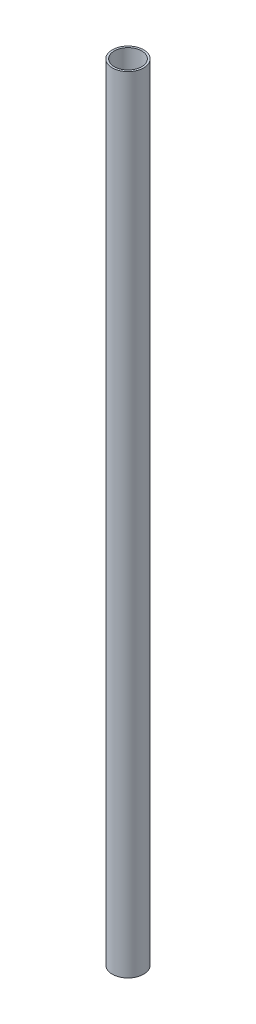
ISO-10303-21;
HEADER;
FILE_DESCRIPTION(('STEP AP214'),'2;1');
FILE_NAME('part.step','',(''),(''),'','','');
FILE_SCHEMA(('AUTOMOTIVE_DESIGN { 1 0 10303 214 1 1 1 1 }'));
ENDSEC;
DATA;
#1=APPLICATION_CONTEXT('core data for automotive mechanical design processes');
#2=APPLICATION_PROTOCOL_DEFINITION('international standard','automotive_design',2000,#1);
#3=PRODUCT_CONTEXT('',#1,'mechanical');
#4=PRODUCT('Part','Part','',(#3));
#5=PRODUCT_RELATED_PRODUCT_CATEGORY('part','',(#4));
#6=PRODUCT_DEFINITION_FORMATION('','',#4);
#7=PRODUCT_DEFINITION_CONTEXT('part definition',#1,'design');
#8=PRODUCT_DEFINITION('design','',#6,#7);
#9=PRODUCT_DEFINITION_SHAPE('','',#8);
#10=(LENGTH_UNIT() NAMED_UNIT(*) SI_UNIT(.MILLI.,.METRE.));
#11=(NAMED_UNIT(*) PLANE_ANGLE_UNIT() SI_UNIT($,.RADIAN.));
#12=(NAMED_UNIT(*) SI_UNIT($,.STERADIAN.) SOLID_ANGLE_UNIT());
#13=UNCERTAINTY_MEASURE_WITH_UNIT(LENGTH_MEASURE(1.E-05),#10,'distance_accuracy_value','');
#14=(GEOMETRIC_REPRESENTATION_CONTEXT(3) GLOBAL_UNCERTAINTY_ASSIGNED_CONTEXT((#13)) GLOBAL_UNIT_ASSIGNED_CONTEXT((#10,
#11,#12)) REPRESENTATION_CONTEXT('',''));
#15=CARTESIAN_POINT('',(0.,0.,0.));
#16=DIRECTION('',(0.,0.,1.));
#17=DIRECTION('',(1.,0.,0.));
#18=AXIS2_PLACEMENT_3D('',#15,#16,#17);
#19=CARTESIAN_POINT('',(0.,200.,0.));
#20=DIRECTION('',(0.,1.,0.));
#21=DIRECTION('',(0.,0.,1.));
#22=AXIS2_PLACEMENT_3D('',#19,#20,#21);
#23=PLANE('',#22);
#24=CARTESIAN_POINT('',(0.,200.,0.));
#25=DIRECTION('',(0.,1.,0.));
#26=DIRECTION('',(0.,0.,1.));
#27=AXIS2_PLACEMENT_3D('',#24,#25,#26);
#28=CIRCLE('',#27,4.);
#29=CARTESIAN_POINT('',(0.,200.,4.));
#30=VERTEX_POINT('',#29);
#31=EDGE_CURVE('E10',#30,#30,#28,.T.);
#32=ORIENTED_EDGE('',*,*,#31,.T.);
#33=EDGE_LOOP('',(#32));
#34=FACE_BOUND('',#33,.T.);
#35=CARTESIAN_POINT('',(0.,200.,0.));
#36=DIRECTION('',(0.,1.,0.));
#37=DIRECTION('',(0.,0.,1.));
#38=AXIS2_PLACEMENT_3D('',#35,#36,#37);
#39=CIRCLE('',#38,3.5);
#40=CARTESIAN_POINT('',(0.,200.,3.5));
#41=VERTEX_POINT('',#40);
#42=EDGE_CURVE('E48',#41,#41,#39,.T.);
#43=ORIENTED_EDGE('',*,*,#42,.F.);
#44=EDGE_LOOP('',(#43));
#45=FACE_BOUND('',#44,.T.);
#46=ADVANCED_FACE('F37',(#34,#45),#23,.T.);
#47=CARTESIAN_POINT('',(0.,0.,0.));
#48=DIRECTION('',(0.,1.,0.));
#49=DIRECTION('',(0.,0.,1.));
#50=AXIS2_PLACEMENT_3D('',#47,#48,#49);
#51=PLANE('',#50);
#52=CARTESIAN_POINT('',(0.,0.,0.));
#53=DIRECTION('',(0.,1.,0.));
#54=DIRECTION('',(0.,0.,1.));
#55=AXIS2_PLACEMENT_3D('',#52,#53,#54);
#56=CIRCLE('',#55,4.);
#57=CARTESIAN_POINT('',(0.,0.,4.));
#58=VERTEX_POINT('',#57);
#59=EDGE_CURVE('E41',#58,#58,#56,.T.);
#60=ORIENTED_EDGE('',*,*,#59,.F.);
#61=EDGE_LOOP('',(#60));
#62=FACE_BOUND('',#61,.T.);
#63=CARTESIAN_POINT('',(0.,0.,0.));
#64=DIRECTION('',(0.,1.,0.));
#65=DIRECTION('',(0.,0.,1.));
#66=AXIS2_PLACEMENT_3D('',#63,#64,#65);
#67=CIRCLE('',#66,3.5);
#68=CARTESIAN_POINT('',(0.,0.,3.5));
#69=VERTEX_POINT('',#68);
#70=EDGE_CURVE('E50',#69,#69,#67,.T.);
#71=ORIENTED_EDGE('',*,*,#70,.T.);
#72=EDGE_LOOP('',(#71));
#73=FACE_BOUND('',#72,.T.);
#74=ADVANCED_FACE('F60',(#62,#73),#51,.F.);
#75=CARTESIAN_POINT('',(0.,200.,0.));
#76=DIRECTION('',(0.,-1.,0.));
#77=DIRECTION('',(0.,0.,-1.));
#78=AXIS2_PLACEMENT_3D('',#75,#76,#77);
#79=CYLINDRICAL_SURFACE('',#78,4.);
#80=ORIENTED_EDGE('',*,*,#31,.F.);
#81=EDGE_LOOP('',(#80));
#82=FACE_BOUND('',#81,.T.);
#83=ORIENTED_EDGE('',*,*,#59,.T.);
#84=EDGE_LOOP('',(#83));
#85=FACE_BOUND('',#84,.T.);
#86=ADVANCED_FACE('F39',(#82,#85),#79,.T.);
#87=CARTESIAN_POINT('',(0.,200.,0.));
#88=DIRECTION('',(0.,-1.,0.));
#89=DIRECTION('',(0.,0.,-1.));
#90=AXIS2_PLACEMENT_3D('',#87,#88,#89);
#91=CYLINDRICAL_SURFACE('',#90,3.5);
#92=ORIENTED_EDGE('',*,*,#42,.T.);
#93=EDGE_LOOP('',(#92));
#94=FACE_BOUND('',#93,.T.);
#95=ORIENTED_EDGE('',*,*,#70,.F.);
#96=EDGE_LOOP('',(#95));
#97=FACE_BOUND('',#96,.T.);
#98=ADVANCED_FACE('F56',(#94,#97),#91,.F.);
#99=CLOSED_SHELL('',(#46,#74,#86,#98));
#100=MANIFOLD_SOLID_BREP('B2',#99);
#101=ADVANCED_BREP_SHAPE_REPRESENTATION('',(#18,#100),#14);
#102=SHAPE_DEFINITION_REPRESENTATION(#9,#101);
ENDSEC;
END-ISO-10303-21;
